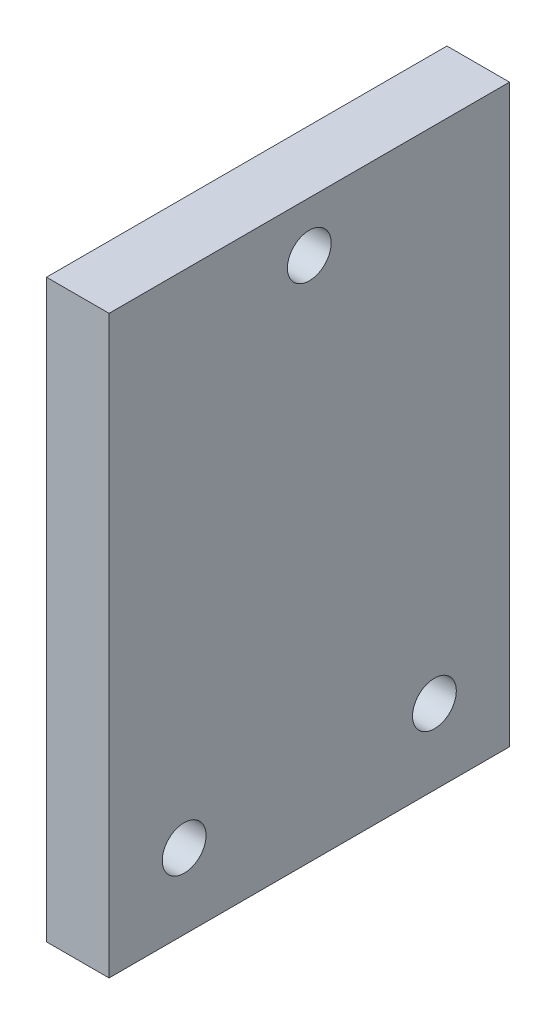
ISO-10303-21;
HEADER;
FILE_DESCRIPTION(('STEP AP214'),'2;1');
FILE_NAME('part.step','',(''),(''),'','','');
FILE_SCHEMA(('AUTOMOTIVE_DESIGN { 1 0 10303 214 1 1 1 1 }'));
ENDSEC;
DATA;
#1=APPLICATION_CONTEXT('core data for automotive mechanical design processes');
#2=APPLICATION_PROTOCOL_DEFINITION('international standard','automotive_design',2000,#1);
#3=PRODUCT_CONTEXT('',#1,'mechanical');
#4=PRODUCT('Part','Part','',(#3));
#5=PRODUCT_RELATED_PRODUCT_CATEGORY('part','',(#4));
#6=PRODUCT_DEFINITION_FORMATION('','',#4);
#7=PRODUCT_DEFINITION_CONTEXT('part definition',#1,'design');
#8=PRODUCT_DEFINITION('design','',#6,#7);
#9=PRODUCT_DEFINITION_SHAPE('','',#8);
#10=(LENGTH_UNIT() NAMED_UNIT(*) SI_UNIT(.MILLI.,.METRE.));
#11=(NAMED_UNIT(*) PLANE_ANGLE_UNIT() SI_UNIT($,.RADIAN.));
#12=(NAMED_UNIT(*) SI_UNIT($,.STERADIAN.) SOLID_ANGLE_UNIT());
#13=UNCERTAINTY_MEASURE_WITH_UNIT(LENGTH_MEASURE(1.E-05),#10,'distance_accuracy_value','');
#14=(GEOMETRIC_REPRESENTATION_CONTEXT(3) GLOBAL_UNCERTAINTY_ASSIGNED_CONTEXT((#13)) GLOBAL_UNIT_ASSIGNED_CONTEXT((#10,
#11,#12)) REPRESENTATION_CONTEXT('',''));
#15=CARTESIAN_POINT('',(0.,0.,0.));
#16=DIRECTION('',(0.,0.,1.));
#17=DIRECTION('',(1.,0.,0.));
#18=AXIS2_PLACEMENT_3D('',#15,#16,#17);
#19=CARTESIAN_POINT('',(0.,46.,0.));
#20=DIRECTION('',(0.,0.,-1.));
#21=DIRECTION('',(-1.,0.,0.));
#22=AXIS2_PLACEMENT_3D('',#19,#20,#21);
#23=PLANE('',#22);
#24=DIRECTION('',(1.,0.,0.));
#25=VECTOR('',#24,1.);
#26=CARTESIAN_POINT('',(0.,46.,0.));
#27=LINE('',#26,#25);
#28=CARTESIAN_POINT('',(50.,46.,0.));
#29=VERTEX_POINT('',#28);
#30=CARTESIAN_POINT('',(55.,46.,0.));
#31=VERTEX_POINT('',#30);
#32=EDGE_CURVE('E88',#29,#31,#27,.T.);
#33=ORIENTED_EDGE('',*,*,#32,.F.);
#34=DIRECTION('',(0.,-1.,0.));
#35=VECTOR('',#34,1.);
#36=CARTESIAN_POINT('',(50.,45.,0.));
#37=LINE('',#36,#35);
#38=CARTESIAN_POINT('',(50.,0.,0.));
#39=VERTEX_POINT('',#38);
#40=EDGE_CURVE('E115',#29,#39,#37,.T.);
#41=ORIENTED_EDGE('',*,*,#40,.T.);
#42=DIRECTION('',(1.,0.,0.));
#43=VECTOR('',#42,1.);
#44=CARTESIAN_POINT('',(0.,0.,0.));
#45=LINE('',#44,#43);
#46=CARTESIAN_POINT('',(55.,0.,0.));
#47=VERTEX_POINT('',#46);
#48=EDGE_CURVE('E79',#39,#47,#45,.T.);
#49=ORIENTED_EDGE('',*,*,#48,.T.);
#50=DIRECTION('',(0.,-1.,0.));
#51=VECTOR('',#50,1.);
#52=CARTESIAN_POINT('',(55.,46.,0.));
#53=LINE('',#52,#51);
#54=EDGE_CURVE('E11',#31,#47,#53,.T.);
#55=ORIENTED_EDGE('',*,*,#54,.F.);
#56=EDGE_LOOP('',(#33,#41,#49,#55));
#57=FACE_BOUND('',#56,.T.);
#58=ADVANCED_FACE('F33',(#57),#23,.F.);
#59=CARTESIAN_POINT('',(55.,46.,0.));
#60=DIRECTION('',(-1.,0.,0.));
#61=DIRECTION('',(0.,0.,1.));
#62=AXIS2_PLACEMENT_3D('',#59,#60,#61);
#63=PLANE('',#62);
#64=CARTESIAN_POINT('',(55.,6.,-26.));
#65=DIRECTION('',(1.,0.,0.));
#66=DIRECTION('',(0.,0.,-1.));
#67=AXIS2_PLACEMENT_3D('',#64,#65,#66);
#68=CIRCLE('',#67,1.75);
#69=CARTESIAN_POINT('',(55.,6.,-27.75));
#70=VERTEX_POINT('',#69);
#71=EDGE_CURVE('E98',#70,#70,#68,.T.);
#72=ORIENTED_EDGE('',*,*,#71,.F.);
#73=EDGE_LOOP('',(#72));
#74=FACE_BOUND('',#73,.T.);
#75=CARTESIAN_POINT('',(55.,42.,-16.));
#76=DIRECTION('',(1.,0.,0.));
#77=DIRECTION('',(0.,0.,-1.));
#78=AXIS2_PLACEMENT_3D('',#75,#76,#77);
#79=CIRCLE('',#78,1.75);
#80=CARTESIAN_POINT('',(55.,42.,-17.75));
#81=VERTEX_POINT('',#80);
#82=EDGE_CURVE('E103',#81,#81,#79,.T.);
#83=ORIENTED_EDGE('',*,*,#82,.F.);
#84=EDGE_LOOP('',(#83));
#85=FACE_BOUND('',#84,.T.);
#86=CARTESIAN_POINT('',(55.,6.,-6.));
#87=DIRECTION('',(1.,0.,0.));
#88=DIRECTION('',(0.,0.,-1.));
#89=AXIS2_PLACEMENT_3D('',#86,#87,#88);
#90=CIRCLE('',#89,1.75);
#91=CARTESIAN_POINT('',(55.,6.,-7.75));
#92=VERTEX_POINT('',#91);
#93=EDGE_CURVE('E95',#92,#92,#90,.T.);
#94=ORIENTED_EDGE('',*,*,#93,.F.);
#95=EDGE_LOOP('',(#94));
#96=FACE_BOUND('',#95,.T.);
#97=DIRECTION('',(0.,0.,-1.));
#98=VECTOR('',#97,1.);
#99=CARTESIAN_POINT('',(55.,0.,0.));
#100=LINE('',#99,#98);
#101=CARTESIAN_POINT('',(55.,0.,-32.));
#102=VERTEX_POINT('',#101);
#103=EDGE_CURVE('E70',#47,#102,#100,.T.);
#104=ORIENTED_EDGE('',*,*,#103,.T.);
#105=DIRECTION('',(0.,-1.,0.));
#106=VECTOR('',#105,1.);
#107=CARTESIAN_POINT('',(55.,46.,-32.));
#108=LINE('',#107,#106);
#109=CARTESIAN_POINT('',(55.,46.,-32.));
#110=VERTEX_POINT('',#109);
#111=EDGE_CURVE('E41',#110,#102,#108,.T.);
#112=ORIENTED_EDGE('',*,*,#111,.F.);
#113=DIRECTION('',(0.,0.,-1.));
#114=VECTOR('',#113,1.);
#115=CARTESIAN_POINT('',(55.,46.,0.));
#116=LINE('',#115,#114);
#117=EDGE_CURVE('E58',#31,#110,#116,.T.);
#118=ORIENTED_EDGE('',*,*,#117,.F.);
#119=ORIENTED_EDGE('',*,*,#54,.T.);
#120=EDGE_LOOP('',(#104,#112,#118,#119));
#121=FACE_BOUND('',#120,.T.);
#122=ADVANCED_FACE('F72',(#74,#85,#96,#121),#63,.F.);
#123=CARTESIAN_POINT('',(0.,46.,-32.));
#124=DIRECTION('',(0.,0.,1.));
#125=DIRECTION('',(1.,0.,0.));
#126=AXIS2_PLACEMENT_3D('',#123,#124,#125);
#127=PLANE('',#126);
#128=DIRECTION('',(0.,-1.,0.));
#129=VECTOR('',#128,1.);
#130=CARTESIAN_POINT('',(50.,45.,-32.));
#131=LINE('',#130,#129);
#132=CARTESIAN_POINT('',(50.,46.,-32.));
#133=VERTEX_POINT('',#132);
#134=CARTESIAN_POINT('',(50.,0.,-32.));
#135=VERTEX_POINT('',#134);
#136=EDGE_CURVE('E49',#133,#135,#131,.T.);
#137=ORIENTED_EDGE('',*,*,#136,.F.);
#138=DIRECTION('',(-1.,0.,0.));
#139=VECTOR('',#138,1.);
#140=CARTESIAN_POINT('',(0.,46.,-32.));
#141=LINE('',#140,#139);
#142=EDGE_CURVE('E84',#110,#133,#141,.T.);
#143=ORIENTED_EDGE('',*,*,#142,.F.);
#144=ORIENTED_EDGE('',*,*,#111,.T.);
#145=DIRECTION('',(-1.,0.,0.));
#146=VECTOR('',#145,1.);
#147=CARTESIAN_POINT('',(0.,0.,-32.));
#148=LINE('',#147,#146);
#149=EDGE_CURVE('E78',#102,#135,#148,.T.);
#150=ORIENTED_EDGE('',*,*,#149,.T.);
#151=EDGE_LOOP('',(#137,#143,#144,#150));
#152=FACE_BOUND('',#151,.T.);
#153=ADVANCED_FACE('F83',(#152),#127,.F.);
#154=CARTESIAN_POINT('',(0.,46.,0.));
#155=DIRECTION('',(0.,-1.,0.));
#156=DIRECTION('',(0.,0.,-1.));
#157=AXIS2_PLACEMENT_3D('',#154,#155,#156);
#158=PLANE('',#157);
#159=ORIENTED_EDGE('',*,*,#142,.T.);
#160=DIRECTION('',(0.,0.,-1.));
#161=VECTOR('',#160,1.);
#162=CARTESIAN_POINT('',(50.,46.,-32.));
#163=LINE('',#162,#161);
#164=EDGE_CURVE('E108',#29,#133,#163,.T.);
#165=ORIENTED_EDGE('',*,*,#164,.F.);
#166=ORIENTED_EDGE('',*,*,#32,.T.);
#167=ORIENTED_EDGE('',*,*,#117,.T.);
#168=EDGE_LOOP('',(#159,#165,#166,#167));
#169=FACE_BOUND('',#168,.T.);
#170=ADVANCED_FACE('F129',(#169),#158,.F.);
#171=CARTESIAN_POINT('',(0.,0.,0.));
#172=DIRECTION('',(0.,-1.,0.));
#173=DIRECTION('',(0.,0.,-1.));
#174=AXIS2_PLACEMENT_3D('',#171,#172,#173);
#175=PLANE('',#174);
#176=DIRECTION('',(0.,0.,1.));
#177=VECTOR('',#176,1.);
#178=CARTESIAN_POINT('',(50.,0.,0.));
#179=LINE('',#178,#177);
#180=EDGE_CURVE('E87',#135,#39,#179,.T.);
#181=ORIENTED_EDGE('',*,*,#180,.F.);
#182=ORIENTED_EDGE('',*,*,#149,.F.);
#183=ORIENTED_EDGE('',*,*,#103,.F.);
#184=ORIENTED_EDGE('',*,*,#48,.F.);
#185=EDGE_LOOP('',(#181,#182,#183,#184));
#186=FACE_BOUND('',#185,.T.);
#187=ADVANCED_FACE('F86',(#186),#175,.T.);
#188=CARTESIAN_POINT('',(50.,45.,0.));
#189=DIRECTION('',(1.,0.,0.));
#190=DIRECTION('',(0.,0.,-1.));
#191=AXIS2_PLACEMENT_3D('',#188,#189,#190);
#192=PLANE('',#191);
#193=CARTESIAN_POINT('',(50.,6.,-26.));
#194=DIRECTION('',(1.,0.,0.));
#195=DIRECTION('',(0.,0.,-1.));
#196=AXIS2_PLACEMENT_3D('',#193,#194,#195);
#197=CIRCLE('',#196,1.75);
#198=CARTESIAN_POINT('',(50.,6.,-27.75));
#199=VERTEX_POINT('',#198);
#200=EDGE_CURVE('E36',#199,#199,#197,.T.);
#201=ORIENTED_EDGE('',*,*,#200,.T.);
#202=EDGE_LOOP('',(#201));
#203=FACE_BOUND('',#202,.T.);
#204=CARTESIAN_POINT('',(50.,42.,-16.));
#205=DIRECTION('',(1.,0.,0.));
#206=DIRECTION('',(0.,0.,-1.));
#207=AXIS2_PLACEMENT_3D('',#204,#205,#206);
#208=CIRCLE('',#207,1.75);
#209=CARTESIAN_POINT('',(50.,42.,-17.75));
#210=VERTEX_POINT('',#209);
#211=EDGE_CURVE('E96',#210,#210,#208,.T.);
#212=ORIENTED_EDGE('',*,*,#211,.T.);
#213=EDGE_LOOP('',(#212));
#214=FACE_BOUND('',#213,.T.);
#215=CARTESIAN_POINT('',(50.,6.,-6.));
#216=DIRECTION('',(1.,0.,0.));
#217=DIRECTION('',(0.,0.,-1.));
#218=AXIS2_PLACEMENT_3D('',#215,#216,#217);
#219=CIRCLE('',#218,1.75);
#220=CARTESIAN_POINT('',(50.,6.,-7.75));
#221=VERTEX_POINT('',#220);
#222=EDGE_CURVE('E93',#221,#221,#219,.T.);
#223=ORIENTED_EDGE('',*,*,#222,.T.);
#224=EDGE_LOOP('',(#223));
#225=FACE_BOUND('',#224,.T.);
#226=ORIENTED_EDGE('',*,*,#180,.T.);
#227=ORIENTED_EDGE('',*,*,#40,.F.);
#228=ORIENTED_EDGE('',*,*,#164,.T.);
#229=ORIENTED_EDGE('',*,*,#136,.T.);
#230=EDGE_LOOP('',(#226,#227,#228,#229));
#231=FACE_BOUND('',#230,.T.);
#232=ADVANCED_FACE('F128',(#203,#214,#225,#231),#192,.F.);
#233=CARTESIAN_POINT('',(0.,6.,-6.));
#234=DIRECTION('',(1.,0.,0.));
#235=DIRECTION('',(0.,0.,-1.));
#236=AXIS2_PLACEMENT_3D('',#233,#234,#235);
#237=CYLINDRICAL_SURFACE('',#236,1.75);
#238=ORIENTED_EDGE('',*,*,#93,.T.);
#239=EDGE_LOOP('',(#238));
#240=FACE_BOUND('',#239,.T.);
#241=ORIENTED_EDGE('',*,*,#222,.F.);
#242=EDGE_LOOP('',(#241));
#243=FACE_BOUND('',#242,.T.);
#244=ADVANCED_FACE('F151',(#240,#243),#237,.F.);
#245=CARTESIAN_POINT('',(0.,42.,-16.));
#246=DIRECTION('',(1.,0.,0.));
#247=DIRECTION('',(0.,0.,-1.));
#248=AXIS2_PLACEMENT_3D('',#245,#246,#247);
#249=CYLINDRICAL_SURFACE('',#248,1.75);
#250=ORIENTED_EDGE('',*,*,#82,.T.);
#251=EDGE_LOOP('',(#250));
#252=FACE_BOUND('',#251,.T.);
#253=ORIENTED_EDGE('',*,*,#211,.F.);
#254=EDGE_LOOP('',(#253));
#255=FACE_BOUND('',#254,.T.);
#256=ADVANCED_FACE('F154',(#252,#255),#249,.F.);
#257=CARTESIAN_POINT('',(0.,6.,-26.));
#258=DIRECTION('',(1.,0.,0.));
#259=DIRECTION('',(0.,0.,-1.));
#260=AXIS2_PLACEMENT_3D('',#257,#258,#259);
#261=CYLINDRICAL_SURFACE('',#260,1.75);
#262=ORIENTED_EDGE('',*,*,#71,.T.);
#263=EDGE_LOOP('',(#262));
#264=FACE_BOUND('',#263,.T.);
#265=ORIENTED_EDGE('',*,*,#200,.F.);
#266=EDGE_LOOP('',(#265));
#267=FACE_BOUND('',#266,.T.);
#268=ADVANCED_FACE('F165',(#264,#267),#261,.F.);
#269=CLOSED_SHELL('',(#58,#122,#153,#170,#187,#232,#244,#256,#268));
#270=MANIFOLD_SOLID_BREP('B2',#269);
#271=ADVANCED_BREP_SHAPE_REPRESENTATION('',(#18,#270),#14);
#272=SHAPE_DEFINITION_REPRESENTATION(#9,#271);
ENDSEC;
END-ISO-10303-21;
